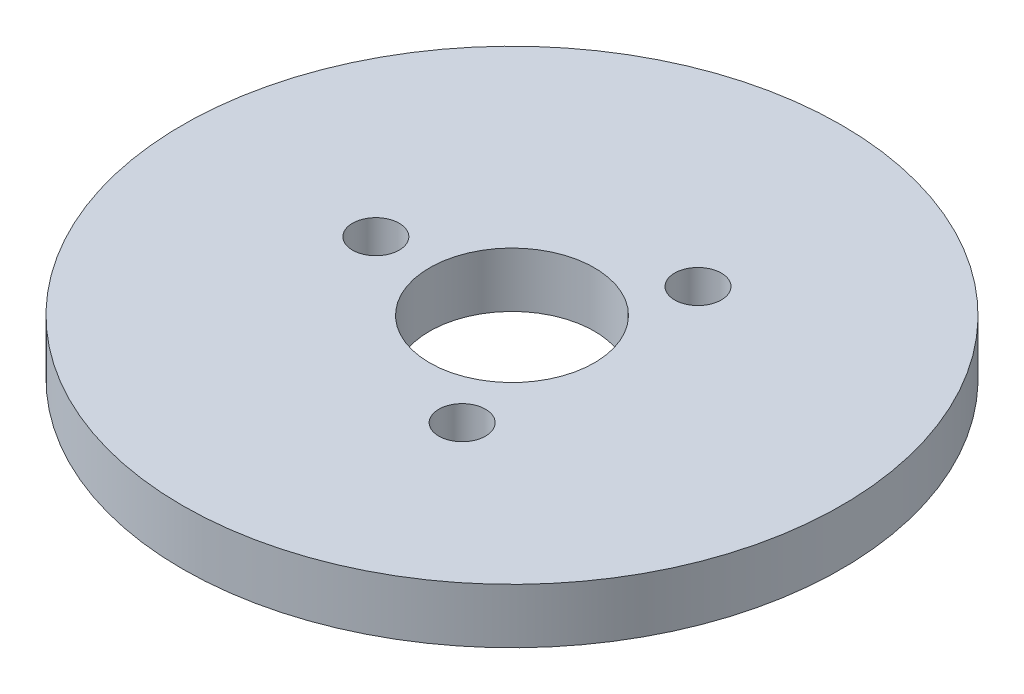
ISO-10303-21;
HEADER;
FILE_DESCRIPTION(('STEP AP214'),'2;1');
FILE_NAME('part.step','',(''),(''),'','','');
FILE_SCHEMA(('AUTOMOTIVE_DESIGN { 1 0 10303 214 1 1 1 1 }'));
ENDSEC;
DATA;
#1=APPLICATION_CONTEXT('core data for automotive mechanical design processes');
#2=APPLICATION_PROTOCOL_DEFINITION('international standard','automotive_design',2000,#1);
#3=PRODUCT_CONTEXT('',#1,'mechanical');
#4=PRODUCT('Part','Part','',(#3));
#5=PRODUCT_RELATED_PRODUCT_CATEGORY('part','',(#4));
#6=PRODUCT_DEFINITION_FORMATION('','',#4);
#7=PRODUCT_DEFINITION_CONTEXT('part definition',#1,'design');
#8=PRODUCT_DEFINITION('design','',#6,#7);
#9=PRODUCT_DEFINITION_SHAPE('','',#8);
#10=(LENGTH_UNIT() NAMED_UNIT(*) SI_UNIT(.MILLI.,.METRE.));
#11=(NAMED_UNIT(*) PLANE_ANGLE_UNIT() SI_UNIT($,.RADIAN.));
#12=(NAMED_UNIT(*) SI_UNIT($,.STERADIAN.) SOLID_ANGLE_UNIT());
#13=UNCERTAINTY_MEASURE_WITH_UNIT(LENGTH_MEASURE(1.E-05),#10,'distance_accuracy_value','');
#14=(GEOMETRIC_REPRESENTATION_CONTEXT(3) GLOBAL_UNCERTAINTY_ASSIGNED_CONTEXT((#13)) GLOBAL_UNIT_ASSIGNED_CONTEXT((#10,
#11,#12)) REPRESENTATION_CONTEXT('',''));
#15=CARTESIAN_POINT('',(0.,0.,0.));
#16=DIRECTION('',(0.,0.,1.));
#17=DIRECTION('',(1.,0.,0.));
#18=AXIS2_PLACEMENT_3D('',#15,#16,#17);
#19=CARTESIAN_POINT('',(0.,15.,0.));
#20=DIRECTION('',(0.,-1.,0.));
#21=DIRECTION('',(0.,0.,-1.));
#22=AXIS2_PLACEMENT_3D('',#19,#20,#21);
#23=CYLINDRICAL_SURFACE('',#22,90.);
#24=CARTESIAN_POINT('',(0.,15.,0.));
#25=DIRECTION('',(0.,1.,0.));
#26=DIRECTION('',(0.,0.,1.));
#27=AXIS2_PLACEMENT_3D('',#24,#25,#26);
#28=CIRCLE('',#27,90.);
#29=CARTESIAN_POINT('',(0.,15.,90.));
#30=VERTEX_POINT('',#29);
#31=EDGE_CURVE('E10',#30,#30,#28,.T.);
#32=ORIENTED_EDGE('',*,*,#31,.F.);
#33=EDGE_LOOP('',(#32));
#34=FACE_BOUND('',#33,.T.);
#35=CARTESIAN_POINT('',(0.,0.,0.));
#36=DIRECTION('',(0.,1.,0.));
#37=DIRECTION('',(0.,0.,1.));
#38=AXIS2_PLACEMENT_3D('',#35,#36,#37);
#39=CIRCLE('',#38,90.);
#40=CARTESIAN_POINT('',(0.,0.,90.));
#41=VERTEX_POINT('',#40);
#42=EDGE_CURVE('E37',#41,#41,#39,.T.);
#43=ORIENTED_EDGE('',*,*,#42,.T.);
#44=EDGE_LOOP('',(#43));
#45=FACE_BOUND('',#44,.T.);
#46=ADVANCED_FACE('F40',(#34,#45),#23,.T.);
#47=CARTESIAN_POINT('',(0.,15.,0.));
#48=DIRECTION('',(0.,1.,0.));
#49=DIRECTION('',(0.,0.,1.));
#50=AXIS2_PLACEMENT_3D('',#47,#48,#49);
#51=PLANE('',#50);
#52=CARTESIAN_POINT('',(18.5906999824203,15.,32.2000369178214));
#53=DIRECTION('',(0.,1.,0.));
#54=DIRECTION('',(0.866025403784436,0.,-0.500000000000004));
#55=AXIS2_PLACEMENT_3D('',#52,#53,#54);
#56=CIRCLE('',#55,6.37686087815526);
#57=CARTESIAN_POINT('',(24.1132234993019,15.,29.0116064787438));
#58=VERTEX_POINT('',#57);
#59=EDGE_CURVE('E70',#58,#58,#56,.T.);
#60=ORIENTED_EDGE('',*,*,#59,.F.);
#61=EDGE_LOOP('',(#60));
#62=FACE_BOUND('',#61,.T.);
#63=CARTESIAN_POINT('',(18.5906999824198,15.,-32.2000369178217));
#64=DIRECTION('',(0.,1.,0.));
#65=DIRECTION('',(-0.866025403784443,0.,-0.499999999999992));
#66=AXIS2_PLACEMENT_3D('',#63,#64,#65);
#67=CIRCLE('',#66,6.37686087815526);
#68=CARTESIAN_POINT('',(13.0681764655382,15.,-35.3884673568993));
#69=VERTEX_POINT('',#68);
#70=EDGE_CURVE('E61',#69,#69,#67,.T.);
#71=ORIENTED_EDGE('',*,*,#70,.F.);
#72=EDGE_LOOP('',(#71));
#73=FACE_BOUND('',#72,.T.);
#74=CARTESIAN_POINT('',(-37.1813999648403,15.,0.));
#75=DIRECTION('',(0.,1.,0.));
#76=DIRECTION('',(0.,0.,1.));
#77=AXIS2_PLACEMENT_3D('',#74,#75,#76);
#78=CIRCLE('',#77,6.37686087815526);
#79=CARTESIAN_POINT('',(-37.1813999648403,15.,6.37686087815526));
#80=VERTEX_POINT('',#79);
#81=EDGE_CURVE('E54',#80,#80,#78,.T.);
#82=ORIENTED_EDGE('',*,*,#81,.F.);
#83=EDGE_LOOP('',(#82));
#84=FACE_BOUND('',#83,.T.);
#85=CARTESIAN_POINT('',(0.,15.,0.));
#86=DIRECTION('',(0.,1.,0.));
#87=DIRECTION('',(0.,0.,1.));
#88=AXIS2_PLACEMENT_3D('',#85,#86,#87);
#89=CIRCLE('',#88,22.5);
#90=CARTESIAN_POINT('',(0.,15.,22.5));
#91=VERTEX_POINT('',#90);
#92=EDGE_CURVE('E50',#91,#91,#89,.T.);
#93=ORIENTED_EDGE('',*,*,#92,.F.);
#94=EDGE_LOOP('',(#93));
#95=FACE_BOUND('',#94,.T.);
#96=ORIENTED_EDGE('',*,*,#31,.T.);
#97=EDGE_LOOP('',(#96));
#98=FACE_BOUND('',#97,.T.);
#99=ADVANCED_FACE('F85',(#62,#73,#84,#95,#98),#51,.T.);
#100=CARTESIAN_POINT('',(0.,0.,0.));
#101=DIRECTION('',(0.,1.,0.));
#102=DIRECTION('',(0.,0.,1.));
#103=AXIS2_PLACEMENT_3D('',#100,#101,#102);
#104=PLANE('',#103);
#105=CARTESIAN_POINT('',(0.,0.,0.));
#106=DIRECTION('',(0.,1.,0.));
#107=DIRECTION('',(0.,0.,1.));
#108=AXIS2_PLACEMENT_3D('',#105,#106,#107);
#109=CIRCLE('',#108,22.5);
#110=CARTESIAN_POINT('',(0.,0.,22.5));
#111=VERTEX_POINT('',#110);
#112=EDGE_CURVE('E47',#111,#111,#109,.T.);
#113=ORIENTED_EDGE('',*,*,#112,.T.);
#114=EDGE_LOOP('',(#113));
#115=FACE_BOUND('',#114,.T.);
#116=ORIENTED_EDGE('',*,*,#42,.F.);
#117=EDGE_LOOP('',(#116));
#118=FACE_BOUND('',#117,.T.);
#119=ADVANCED_FACE('F84',(#115,#118),#104,.F.);
#120=CARTESIAN_POINT('',(0.,15.,0.));
#121=DIRECTION('',(0.,-1.,0.));
#122=DIRECTION('',(0.,0.,-1.));
#123=AXIS2_PLACEMENT_3D('',#120,#121,#122);
#124=CYLINDRICAL_SURFACE('',#123,22.5);
#125=ORIENTED_EDGE('',*,*,#92,.T.);
#126=EDGE_LOOP('',(#125));
#127=FACE_BOUND('',#126,.T.);
#128=ORIENTED_EDGE('',*,*,#112,.F.);
#129=EDGE_LOOP('',(#128));
#130=FACE_BOUND('',#129,.T.);
#131=ADVANCED_FACE('F91',(#127,#130),#124,.F.);
#132=CARTESIAN_POINT('',(-37.1813999648403,0.552206068016746,0.));
#133=DIRECTION('',(0.,1.,0.));
#134=DIRECTION('',(0.,0.,1.));
#135=AXIS2_PLACEMENT_3D('',#132,#133,#134);
#136=CYLINDRICAL_SURFACE('',#135,6.37686087815526);
#137=CARTESIAN_POINT('',(-37.1813999648403,0.552206068016746,0.));
#138=DIRECTION('',(0.,1.,0.));
#139=DIRECTION('',(0.,0.,1.));
#140=AXIS2_PLACEMENT_3D('',#137,#138,#139);
#141=CIRCLE('',#140,6.37686087815526);
#142=CARTESIAN_POINT('',(-37.1813999648403,0.552206068016746,6.37686087815526));
#143=VERTEX_POINT('',#142);
#144=EDGE_CURVE('E55',#143,#143,#141,.T.);
#145=ORIENTED_EDGE('',*,*,#144,.F.);
#146=EDGE_LOOP('',(#145));
#147=FACE_BOUND('',#146,.T.);
#148=ORIENTED_EDGE('',*,*,#81,.T.);
#149=EDGE_LOOP('',(#148));
#150=FACE_BOUND('',#149,.T.);
#151=ADVANCED_FACE('F96',(#147,#150),#136,.F.);
#152=CARTESIAN_POINT('',(-37.1813999648403,0.552206068016746,0.));
#153=DIRECTION('',(0.,1.,0.));
#154=DIRECTION('',(0.,0.,1.));
#155=AXIS2_PLACEMENT_3D('',#152,#153,#154);
#156=PLANE('',#155);
#157=ORIENTED_EDGE('',*,*,#144,.T.);
#158=EDGE_LOOP('',(#157));
#159=FACE_BOUND('',#158,.T.);
#160=ADVANCED_FACE('F127',(#159),#156,.T.);
#161=CARTESIAN_POINT('',(18.5906999824198,0.552206068016746,-32.2000369178217));
#162=DIRECTION('',(0.,1.,0.));
#163=DIRECTION('',(0.,0.,1.));
#164=AXIS2_PLACEMENT_3D('',#161,#162,#163);
#165=CYLINDRICAL_SURFACE('',#164,6.37686087815526);
#166=CARTESIAN_POINT('',(18.5906999824198,0.552206068016746,-32.2000369178217));
#167=DIRECTION('',(0.,1.,0.));
#168=DIRECTION('',(-0.866025403784443,0.,-0.499999999999992));
#169=AXIS2_PLACEMENT_3D('',#166,#167,#168);
#170=CIRCLE('',#169,6.37686087815526);
#171=CARTESIAN_POINT('',(13.0681764655382,0.552206068016746,-35.3884673568993));
#172=VERTEX_POINT('',#171);
#173=EDGE_CURVE('E63',#172,#172,#170,.T.);
#174=ORIENTED_EDGE('',*,*,#173,.F.);
#175=EDGE_LOOP('',(#174));
#176=FACE_BOUND('',#175,.T.);
#177=ORIENTED_EDGE('',*,*,#70,.T.);
#178=EDGE_LOOP('',(#177));
#179=FACE_BOUND('',#178,.T.);
#180=ADVANCED_FACE('F133',(#176,#179),#165,.F.);
#181=CARTESIAN_POINT('',(18.5906999824198,0.552206068016746,-32.2000369178217));
#182=DIRECTION('',(0.,1.,0.));
#183=DIRECTION('',(-0.866025403784443,0.,-0.499999999999992));
#184=AXIS2_PLACEMENT_3D('',#181,#182,#183);
#185=PLANE('',#184);
#186=ORIENTED_EDGE('',*,*,#173,.T.);
#187=EDGE_LOOP('',(#186));
#188=FACE_BOUND('',#187,.T.);
#189=ADVANCED_FACE('F77',(#188),#185,.T.);
#190=CARTESIAN_POINT('',(18.5906999824203,0.552206068016746,32.2000369178214));
#191=DIRECTION('',(0.,1.,0.));
#192=DIRECTION('',(0.,0.,1.));
#193=AXIS2_PLACEMENT_3D('',#190,#191,#192);
#194=CYLINDRICAL_SURFACE('',#193,6.37686087815526);
#195=CARTESIAN_POINT('',(18.5906999824203,0.552206068016746,32.2000369178214));
#196=DIRECTION('',(0.,1.,0.));
#197=DIRECTION('',(0.866025403784436,0.,-0.500000000000004));
#198=AXIS2_PLACEMENT_3D('',#195,#196,#197);
#199=CIRCLE('',#198,6.37686087815526);
#200=CARTESIAN_POINT('',(24.1132234993019,0.552206068016746,29.0116064787438));
#201=VERTEX_POINT('',#200);
#202=EDGE_CURVE('E59',#201,#201,#199,.T.);
#203=ORIENTED_EDGE('',*,*,#202,.F.);
#204=EDGE_LOOP('',(#203));
#205=FACE_BOUND('',#204,.T.);
#206=ORIENTED_EDGE('',*,*,#59,.T.);
#207=EDGE_LOOP('',(#206));
#208=FACE_BOUND('',#207,.T.);
#209=ADVANCED_FACE('F73',(#205,#208),#194,.F.);
#210=CARTESIAN_POINT('',(18.5906999824203,0.552206068016746,32.2000369178214));
#211=DIRECTION('',(0.,1.,0.));
#212=DIRECTION('',(0.866025403784436,0.,-0.500000000000004));
#213=AXIS2_PLACEMENT_3D('',#210,#211,#212);
#214=PLANE('',#213);
#215=ORIENTED_EDGE('',*,*,#202,.T.);
#216=EDGE_LOOP('',(#215));
#217=FACE_BOUND('',#216,.T.);
#218=ADVANCED_FACE('F71',(#217),#214,.T.);
#219=CLOSED_SHELL('',(#46,#99,#119,#131,#151,#160,#180,#189,#209,#218));
#220=MANIFOLD_SOLID_BREP('B2',#219);
#221=ADVANCED_BREP_SHAPE_REPRESENTATION('',(#18,#220),#14);
#222=SHAPE_DEFINITION_REPRESENTATION(#9,#221);
ENDSEC;
END-ISO-10303-21;
